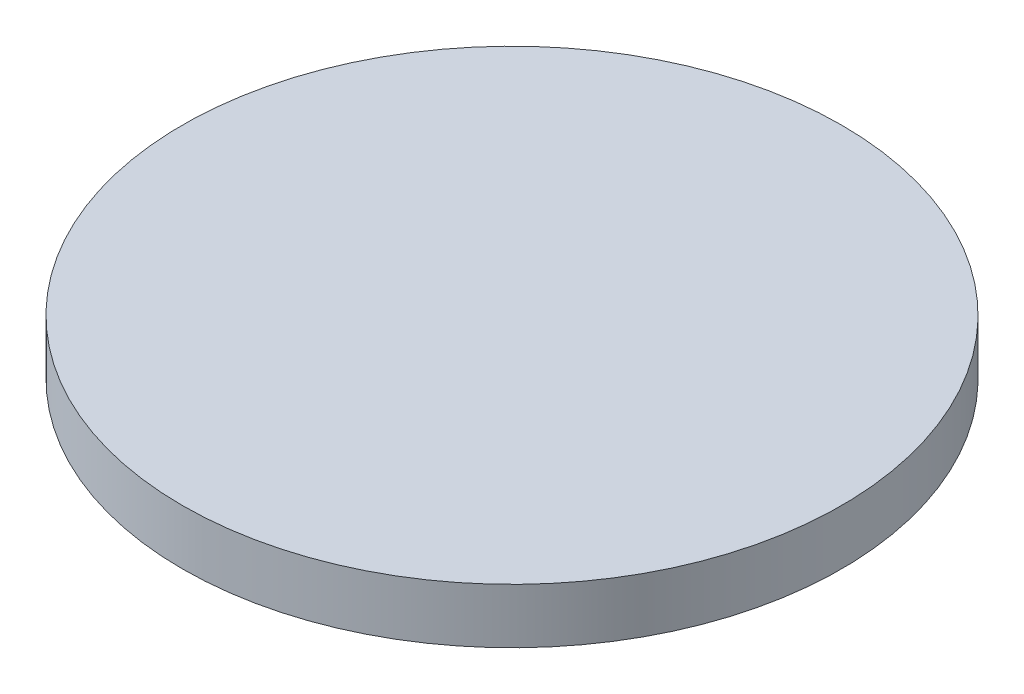
ISO-10303-21;
HEADER;
FILE_DESCRIPTION(('STEP AP214'),'2;1');
FILE_NAME('part.step','',(''),(''),'','','');
FILE_SCHEMA(('AUTOMOTIVE_DESIGN { 1 0 10303 214 1 1 1 1 }'));
ENDSEC;
DATA;
#1=APPLICATION_CONTEXT('core data for automotive mechanical design processes');
#2=APPLICATION_PROTOCOL_DEFINITION('international standard','automotive_design',2000,#1);
#3=PRODUCT_CONTEXT('',#1,'mechanical');
#4=PRODUCT('Part','Part','',(#3));
#5=PRODUCT_RELATED_PRODUCT_CATEGORY('part','',(#4));
#6=PRODUCT_DEFINITION_FORMATION('','',#4);
#7=PRODUCT_DEFINITION_CONTEXT('part definition',#1,'design');
#8=PRODUCT_DEFINITION('design','',#6,#7);
#9=PRODUCT_DEFINITION_SHAPE('','',#8);
#10=(LENGTH_UNIT() NAMED_UNIT(*) SI_UNIT(.MILLI.,.METRE.));
#11=(NAMED_UNIT(*) PLANE_ANGLE_UNIT() SI_UNIT($,.RADIAN.));
#12=(NAMED_UNIT(*) SI_UNIT($,.STERADIAN.) SOLID_ANGLE_UNIT());
#13=UNCERTAINTY_MEASURE_WITH_UNIT(LENGTH_MEASURE(1.E-05),#10,'distance_accuracy_value','');
#14=(GEOMETRIC_REPRESENTATION_CONTEXT(3) GLOBAL_UNCERTAINTY_ASSIGNED_CONTEXT((#13)) GLOBAL_UNIT_ASSIGNED_CONTEXT((#10,
#11,#12)) REPRESENTATION_CONTEXT('',''));
#15=CARTESIAN_POINT('',(0.,0.,0.));
#16=DIRECTION('',(0.,0.,1.));
#17=DIRECTION('',(1.,0.,0.));
#18=AXIS2_PLACEMENT_3D('',#15,#16,#17);
#19=CARTESIAN_POINT('',(0.,10.,0.));
#20=DIRECTION('',(0.,-1.,0.));
#21=DIRECTION('',(0.,0.,-1.));
#22=AXIS2_PLACEMENT_3D('',#19,#20,#21);
#23=CYLINDRICAL_SURFACE('',#22,60.);
#24=CARTESIAN_POINT('',(0.,10.,0.));
#25=DIRECTION('',(0.,1.,0.));
#26=DIRECTION('',(0.,0.,1.));
#27=AXIS2_PLACEMENT_3D('',#24,#25,#26);
#28=CIRCLE('',#27,60.);
#29=CARTESIAN_POINT('',(0.,10.,60.));
#30=VERTEX_POINT('',#29);
#31=EDGE_CURVE('E10',#30,#30,#28,.T.);
#32=ORIENTED_EDGE('',*,*,#31,.F.);
#33=EDGE_LOOP('',(#32));
#34=FACE_BOUND('',#33,.T.);
#35=CARTESIAN_POINT('',(0.,0.,0.));
#36=DIRECTION('',(0.,1.,0.));
#37=DIRECTION('',(0.,0.,1.));
#38=AXIS2_PLACEMENT_3D('',#35,#36,#37);
#39=CIRCLE('',#38,60.);
#40=CARTESIAN_POINT('',(0.,0.,60.));
#41=VERTEX_POINT('',#40);
#42=EDGE_CURVE('E40',#41,#41,#39,.T.);
#43=ORIENTED_EDGE('',*,*,#42,.T.);
#44=EDGE_LOOP('',(#43));
#45=FACE_BOUND('',#44,.T.);
#46=ADVANCED_FACE('F37',(#34,#45),#23,.T.);
#47=CARTESIAN_POINT('',(0.,10.,0.));
#48=DIRECTION('',(0.,1.,0.));
#49=DIRECTION('',(0.,0.,1.));
#50=AXIS2_PLACEMENT_3D('',#47,#48,#49);
#51=PLANE('',#50);
#52=ORIENTED_EDGE('',*,*,#31,.T.);
#53=EDGE_LOOP('',(#52));
#54=FACE_BOUND('',#53,.T.);
#55=ADVANCED_FACE('F70',(#54),#51,.T.);
#56=CARTESIAN_POINT('',(0.,0.,0.));
#57=DIRECTION('',(0.,1.,0.));
#58=DIRECTION('',(0.,0.,1.));
#59=AXIS2_PLACEMENT_3D('',#56,#57,#58);
#60=PLANE('',#59);
#61=CARTESIAN_POINT('',(0.,0.,0.));
#62=DIRECTION('',(0.,-1.,0.));
#63=DIRECTION('',(0.,0.,-1.));
#64=AXIS2_PLACEMENT_3D('',#61,#62,#63);
#65=CIRCLE('',#64,1.5);
#66=CARTESIAN_POINT('',(0.,0.,-1.5));
#67=VERTEX_POINT('',#66);
#68=EDGE_CURVE('E51',#67,#67,#65,.T.);
#69=ORIENTED_EDGE('',*,*,#68,.F.);
#70=EDGE_LOOP('',(#69));
#71=FACE_BOUND('',#70,.T.);
#72=ORIENTED_EDGE('',*,*,#42,.F.);
#73=EDGE_LOOP('',(#72));
#74=FACE_BOUND('',#73,.T.);
#75=ADVANCED_FACE('F64',(#71,#74),#60,.F.);
#76=CARTESIAN_POINT('',(0.,4.,0.));
#77=DIRECTION('',(0.,-1.,0.));
#78=DIRECTION('',(0.,0.,-1.));
#79=AXIS2_PLACEMENT_3D('',#76,#77,#78);
#80=CYLINDRICAL_SURFACE('',#79,1.5);
#81=CARTESIAN_POINT('',(0.,4.,0.));
#82=DIRECTION('',(0.,-1.,0.));
#83=DIRECTION('',(0.,0.,-1.));
#84=AXIS2_PLACEMENT_3D('',#81,#82,#83);
#85=CIRCLE('',#84,1.5);
#86=CARTESIAN_POINT('',(0.,4.,-1.5));
#87=VERTEX_POINT('',#86);
#88=EDGE_CURVE('E49',#87,#87,#85,.T.);
#89=ORIENTED_EDGE('',*,*,#88,.F.);
#90=EDGE_LOOP('',(#89));
#91=FACE_BOUND('',#90,.T.);
#92=ORIENTED_EDGE('',*,*,#68,.T.);
#93=EDGE_LOOP('',(#92));
#94=FACE_BOUND('',#93,.T.);
#95=ADVANCED_FACE('F61',(#91,#94),#80,.F.);
#96=CARTESIAN_POINT('',(0.,4.,0.));
#97=DIRECTION('',(0.,-1.,0.));
#98=DIRECTION('',(0.,0.,-1.));
#99=AXIS2_PLACEMENT_3D('',#96,#97,#98);
#100=PLANE('',#99);
#101=ORIENTED_EDGE('',*,*,#88,.T.);
#102=EDGE_LOOP('',(#101));
#103=FACE_BOUND('',#102,.T.);
#104=ADVANCED_FACE('F59',(#103),#100,.T.);
#105=CLOSED_SHELL('',(#46,#55,#75,#95,#104));
#106=MANIFOLD_SOLID_BREP('B2',#105);
#107=ADVANCED_BREP_SHAPE_REPRESENTATION('',(#18,#106),#14);
#108=SHAPE_DEFINITION_REPRESENTATION(#9,#107);
ENDSEC;
END-ISO-10303-21;
